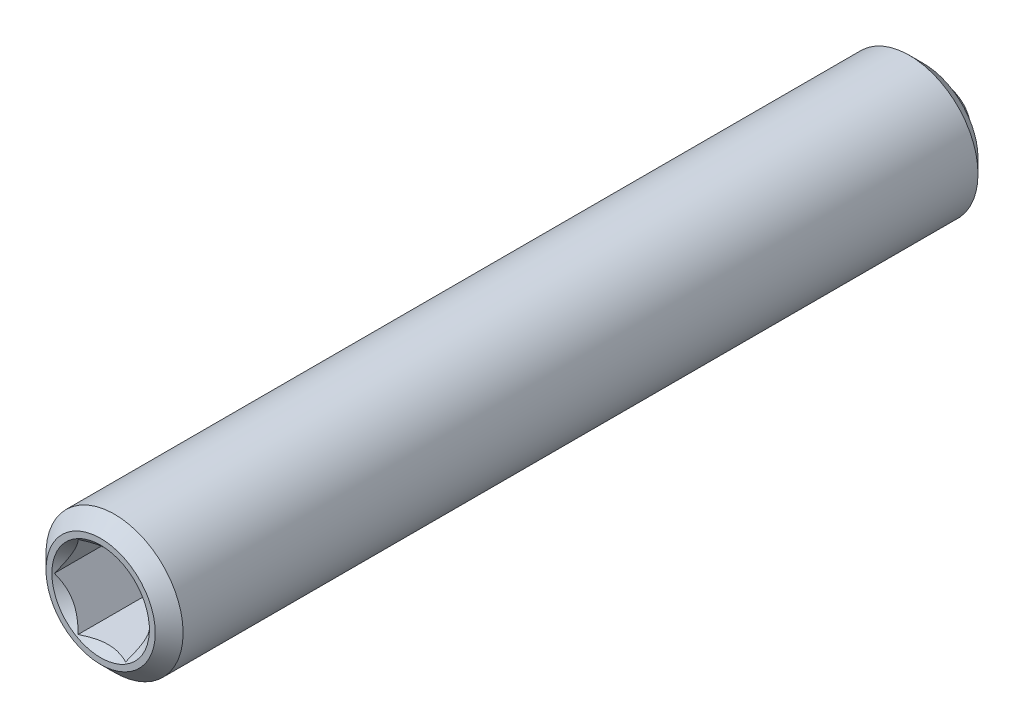
ISO-10303-21;
HEADER;
FILE_DESCRIPTION(('STEP AP214'),'2;1');
FILE_NAME('part.step','',(''),(''),'','','');
FILE_SCHEMA(('AUTOMOTIVE_DESIGN { 1 0 10303 214 1 1 1 1 }'));
ENDSEC;
DATA;
#1=APPLICATION_CONTEXT('core data for automotive mechanical design processes');
#2=APPLICATION_PROTOCOL_DEFINITION('international standard','automotive_design',2000,#1);
#3=PRODUCT_CONTEXT('',#1,'mechanical');
#4=PRODUCT('Part','Part','',(#3));
#5=PRODUCT_RELATED_PRODUCT_CATEGORY('part','',(#4));
#6=PRODUCT_DEFINITION_FORMATION('','',#4);
#7=PRODUCT_DEFINITION_CONTEXT('part definition',#1,'design');
#8=PRODUCT_DEFINITION('design','',#6,#7);
#9=PRODUCT_DEFINITION_SHAPE('','',#8);
#10=(LENGTH_UNIT() NAMED_UNIT(*) SI_UNIT(.MILLI.,.METRE.));
#11=(NAMED_UNIT(*) PLANE_ANGLE_UNIT() SI_UNIT($,.RADIAN.));
#12=(NAMED_UNIT(*) SI_UNIT($,.STERADIAN.) SOLID_ANGLE_UNIT());
#13=UNCERTAINTY_MEASURE_WITH_UNIT(LENGTH_MEASURE(1.E-05),#10,'distance_accuracy_value','');
#14=(GEOMETRIC_REPRESENTATION_CONTEXT(3) GLOBAL_UNCERTAINTY_ASSIGNED_CONTEXT((#13)) GLOBAL_UNIT_ASSIGNED_CONTEXT((#10,
#11,#12)) REPRESENTATION_CONTEXT('',''));
#15=CARTESIAN_POINT('',(0.,0.,0.));
#16=DIRECTION('',(0.,0.,1.));
#17=DIRECTION('',(1.,0.,0.));
#18=AXIS2_PLACEMENT_3D('',#15,#16,#17);
#19=CARTESIAN_POINT('',(-33.1630007981403,28.7089673374794,5.49521483447506));
#20=DIRECTION('',(0.,0.,-1.));
#21=DIRECTION('',(-1.,0.,0.));
#22=AXIS2_PLACEMENT_3D('',#19,#20,#21);
#23=PLANE('',#22);
#24=CARTESIAN_POINT('',(-33.1630007981403,28.7089673374794,5.49521483447506));
#25=DIRECTION('',(0.,0.,-1.));
#26=DIRECTION('',(0.,1.,0.));
#27=AXIS2_PLACEMENT_3D('',#24,#25,#26);
#28=CIRCLE('',#27,0.889);
#29=CARTESIAN_POINT('',(-33.1630007981403,29.5979673374794,5.49521483447506));
#30=VERTEX_POINT('',#29);
#31=EDGE_CURVE('P0_E164',#30,#30,#28,.T.);
#32=ORIENTED_EDGE('',*,*,#31,.T.);
#33=EDGE_LOOP('',(#32));
#34=FACE_BOUND('',#33,.T.);
#35=CARTESIAN_POINT('',(-33.1630007981403,28.7089673374794,5.49521483447506));
#36=DIRECTION('',(0.,0.,1.));
#37=DIRECTION('',(1.,0.,0.));
#38=AXIS2_PLACEMENT_3D('',#35,#36,#37);
#39=CIRCLE('',#38,0.996);
#40=CARTESIAN_POINT('',(-32.1670007981403,28.7089673374794,5.49521483447506));
#41=VERTEX_POINT('',#40);
#42=EDGE_CURVE('P0_E29',#41,#41,#39,.T.);
#43=ORIENTED_EDGE('',*,*,#42,.T.);
#44=EDGE_LOOP('',(#43));
#45=FACE_BOUND('',#44,.T.);
#46=ADVANCED_FACE('P0_F17',(#34,#45),#23,.F.);
#47=CARTESIAN_POINT('',(-33.1630007981403,28.7089673374794,5.24121483447506));
#48=DIRECTION('',(0.,0.,-1.));
#49=DIRECTION('',(-1.,0.,0.));
#50=AXIS2_PLACEMENT_3D('',#47,#48,#49);
#51=CONICAL_SURFACE('',#50,1.25,0.785398163397454);
#52=ORIENTED_EDGE('',*,*,#42,.F.);
#53=EDGE_LOOP('',(#52));
#54=FACE_BOUND('',#53,.T.);
#55=CARTESIAN_POINT('',(-33.1630007981403,28.7089673374794,5.24121483447506));
#56=DIRECTION('',(0.,0.,1.));
#57=DIRECTION('',(1.,0.,0.));
#58=AXIS2_PLACEMENT_3D('',#55,#56,#57);
#59=CIRCLE('',#58,1.25);
#60=CARTESIAN_POINT('',(-31.9130007981403,28.7089673374794,5.24121483447506));
#61=VERTEX_POINT('',#60);
#62=EDGE_CURVE('P0_E113',#61,#61,#59,.T.);
#63=ORIENTED_EDGE('',*,*,#62,.T.);
#64=EDGE_LOOP('',(#63));
#65=FACE_BOUND('',#64,.T.);
#66=ADVANCED_FACE('P0_F119',(#54,#65),#51,.T.);
#67=CARTESIAN_POINT('',(-33.1630007981403,28.7089673374794,57.6778825031788));
#68=DIRECTION('',(0.,0.,1.));
#69=DIRECTION('',(1.,0.,0.));
#70=AXIS2_PLACEMENT_3D('',#67,#68,#69);
#71=CYLINDRICAL_SURFACE('',#70,1.25);
#72=ORIENTED_EDGE('',*,*,#62,.F.);
#73=EDGE_LOOP('',(#72));
#74=FACE_BOUND('',#73,.T.);
#75=CARTESIAN_POINT('',(-33.1630007981403,28.7089673374794,-9.25078516552494));
#76=DIRECTION('',(0.,0.,1.));
#77=DIRECTION('',(1.,0.,0.));
#78=AXIS2_PLACEMENT_3D('',#75,#76,#77);
#79=CIRCLE('',#78,1.25);
#80=CARTESIAN_POINT('',(-31.9130007981403,28.7089673374794,-9.25078516552494));
#81=VERTEX_POINT('',#80);
#82=EDGE_CURVE('P0_E110',#81,#81,#79,.T.);
#83=ORIENTED_EDGE('',*,*,#82,.T.);
#84=EDGE_LOOP('',(#83));
#85=FACE_BOUND('',#84,.T.);
#86=ADVANCED_FACE('P0_F122',(#74,#85),#71,.T.);
#87=CARTESIAN_POINT('',(-33.1630007981403,28.7089673374794,-9.50478516552494));
#88=DIRECTION('',(0.,0.,1.));
#89=DIRECTION('',(1.,0.,0.));
#90=AXIS2_PLACEMENT_3D('',#87,#88,#89);
#91=CONICAL_SURFACE('',#90,0.996,0.78539816339744);
#92=ORIENTED_EDGE('',*,*,#82,.F.);
#93=EDGE_LOOP('',(#92));
#94=FACE_BOUND('',#93,.T.);
#95=CARTESIAN_POINT('',(-33.1630007981403,28.7089673374794,-9.50478516552494));
#96=DIRECTION('',(0.,0.,1.));
#97=DIRECTION('',(1.,0.,0.));
#98=AXIS2_PLACEMENT_3D('',#95,#96,#97);
#99=CIRCLE('',#98,0.996);
#100=CARTESIAN_POINT('',(-32.1670007981403,28.7089673374794,-9.50478516552494));
#101=VERTEX_POINT('',#100);
#102=EDGE_CURVE('P0_E107',#101,#101,#99,.T.);
#103=ORIENTED_EDGE('',*,*,#102,.T.);
#104=EDGE_LOOP('',(#103));
#105=FACE_BOUND('',#104,.T.);
#106=ADVANCED_FACE('P0_F127',(#94,#105),#91,.T.);
#107=CARTESIAN_POINT('',(-33.1630007981403,29.7049673374794,-9.50478516552494));
#108=DIRECTION('',(0.,0.,1.));
#109=DIRECTION('',(1.,0.,0.));
#110=AXIS2_PLACEMENT_3D('',#107,#108,#109);
#111=PLANE('',#110);
#112=ORIENTED_EDGE('',*,*,#102,.F.);
#113=EDGE_LOOP('',(#112));
#114=FACE_BOUND('',#113,.T.);
#115=CARTESIAN_POINT('',(-33.1630007981403,28.7089673374794,-9.50478516552494));
#116=DIRECTION('',(0.,0.,1.));
#117=DIRECTION('',(1.,0.,0.));
#118=AXIS2_PLACEMENT_3D('',#115,#116,#117);
#119=CIRCLE('',#118,0.75);
#120=CARTESIAN_POINT('',(-32.4130007981403,28.7089673374794,-9.50478516552494));
#121=VERTEX_POINT('',#120);
#122=EDGE_CURVE('P0_E104',#121,#121,#119,.T.);
#123=ORIENTED_EDGE('',*,*,#122,.T.);
#124=EDGE_LOOP('',(#123));
#125=FACE_BOUND('',#124,.T.);
#126=ADVANCED_FACE('P0_F133',(#114,#125),#111,.F.);
#127=CARTESIAN_POINT('',(-33.1630007981403,28.7089673374794,57.6778825031788));
#128=DIRECTION('',(0.,0.,1.));
#129=DIRECTION('',(1.,0.,0.));
#130=AXIS2_PLACEMENT_3D('',#127,#128,#129);
#131=CYLINDRICAL_SURFACE('',#130,0.75);
#132=ORIENTED_EDGE('',*,*,#122,.F.);
#133=EDGE_LOOP('',(#132));
#134=FACE_BOUND('',#133,.T.);
#135=CARTESIAN_POINT('',(-33.1630007981403,28.7089673374794,-9.00292499374513));
#136=DIRECTION('',(0.,0.,1.));
#137=DIRECTION('',(1.,0.,0.));
#138=AXIS2_PLACEMENT_3D('',#135,#136,#137);
#139=CIRCLE('',#138,0.75);
#140=CARTESIAN_POINT('',(-32.4130007981403,28.7089673374794,-9.00292499374513));
#141=VERTEX_POINT('',#140);
#142=EDGE_CURVE('P0_E101',#141,#141,#139,.T.);
#143=ORIENTED_EDGE('',*,*,#142,.T.);
#144=EDGE_LOOP('',(#143));
#145=FACE_BOUND('',#144,.T.);
#146=ADVANCED_FACE('P0_F139',(#134,#145),#131,.F.);
#147=CARTESIAN_POINT('',(-33.1630007981403,28.7089673374794,-8.25292499374511));
#148=DIRECTION('',(0.,0.,-1.));
#149=DIRECTION('',(-1.,0.,0.));
#150=AXIS2_PLACEMENT_3D('',#147,#148,#149);
#151=CONICAL_SURFACE('',#150,0.,0.785398163397436);
#152=ORIENTED_EDGE('',*,*,#142,.F.);
#153=EDGE_LOOP('',(#152));
#154=FACE_BOUND('',#153,.T.);
#155=CARTESIAN_POINT('',(-33.1630007981403,28.7089673374794,-8.25292499374511));
#156=VERTEX_POINT('',#155);
#157=VERTEX_LOOP('',#156);
#158=FACE_BOUND('',#157,.T.);
#159=ADVANCED_FACE('P0_F145',(#154,#158),#151,.F.);
#160=CARTESIAN_POINT('',(-33.1630007981403,28.7089673374794,4.60621483447507));
#161=DIRECTION('',(0.,0.,1.));
#162=DIRECTION('',(0.,-1.,0.));
#163=AXIS2_PLACEMENT_3D('',#160,#161,#162);
#164=CONICAL_SURFACE('',#163,0.,0.785398163397454);
#165=ORIENTED_EDGE('',*,*,#31,.F.);
#166=EDGE_LOOP('',(#165));
#167=FACE_BOUND('',#166,.T.);
#168=CARTESIAN_POINT('',(-34.0425134321986,27.9589673374794,5.76208786966026));
#169=CARTESIAN_POINT('',(-34.0211681100344,27.9589673374794,5.74584847947383));
#170=CARTESIAN_POINT('',(-33.9997055705422,27.9589673374794,5.72976358783385));
#171=CARTESIAN_POINT('',(-33.9564979950275,27.9589673374794,5.69796706739638));
#172=CARTESIAN_POINT('',(-33.9347528915436,27.9589673374794,5.68225553036631));
#173=CARTESIAN_POINT('',(-33.8687032144859,27.9589673374794,5.63555296646633));
#174=CARTESIAN_POINT('',(-33.8239085172943,27.9589673374794,5.60524382432147));
#175=CARTESIAN_POINT('',(-33.7298709247186,27.9589673374794,5.54559584174304));
#176=CARTESIAN_POINT('',(-33.6805219918868,27.9589673374794,5.51642227384625));
#177=CARTESIAN_POINT('',(-33.579342395383,27.9589673374794,5.46295382695284));
#178=CARTESIAN_POINT('',(-33.5275208693121,27.9589673374794,5.43864248318659));
#179=CARTESIAN_POINT('',(-33.4498788861714,27.9589673374794,5.40889806815176));
#180=CARTESIAN_POINT('',(-33.4252462031009,27.9589673374794,5.40038894634061));
#181=CARTESIAN_POINT('',(-33.3753858857222,27.9589673374794,5.38534110821305));
#182=CARTESIAN_POINT('',(-33.3501582118539,27.9589673374794,5.37880252331568));
#183=CARTESIAN_POINT('',(-33.2746553170791,27.9589673374794,5.36292205991524));
#184=CARTESIAN_POINT('',(-33.2235971883066,27.9589673374794,5.35692036145107));
#185=CARTESIAN_POINT('',(-33.1233397305914,27.9589673374794,5.35565407881637));
#186=CARTESIAN_POINT('',(-33.0741456969587,27.9589673374794,5.35997925251151));
#187=CARTESIAN_POINT('',(-33.0012050800911,27.9589673374794,5.37307755969887));
#188=CARTESIAN_POINT('',(-32.9768127738478,27.9589673374794,5.37862812797235));
#189=CARTESIAN_POINT('',(-32.9285520824627,27.9589673374794,5.39166394378376));
#190=CARTESIAN_POINT('',(-32.9046836591211,27.9589673374794,5.39914904975033));
#191=CARTESIAN_POINT('',(-32.8302496642989,27.9589673374794,5.42532907949656));
#192=CARTESIAN_POINT('',(-32.7807289039953,27.9589673374794,5.44697769298002));
#193=CARTESIAN_POINT('',(-32.6840052994642,27.9589673374794,5.4951286727266));
#194=CARTESIAN_POINT('',(-32.6368115002835,27.9589673374794,5.52164833509715));
#195=CARTESIAN_POINT('',(-32.546608344391,27.9589673374794,5.57638182509845));
#196=CARTESIAN_POINT('',(-32.5035074965681,27.9589673374794,5.60444679240507));
#197=CARTESIAN_POINT('',(-32.4400071849266,27.9589673374794,5.64784121680964));
#198=CARTESIAN_POINT('',(-32.4191140713775,27.9589673374794,5.66246076309093));
#199=CARTESIAN_POINT('',(-32.3776138434408,27.9589673374794,5.69208888193887));
#200=CARTESIAN_POINT('',(-32.3570066523079,27.9589673374794,5.70709734688724));
#201=CARTESIAN_POINT('',(-32.3365186272487,27.9589673374794,5.72226715350033));
#202=B_SPLINE_CURVE_WITH_KNOTS('',3,(#168,#169,#170,#171,#172,#173,#174,#175,#176,#177,#178,
#179,#180,#181,#182,#183,#184,#185,#186,#187,#188,#189,#190,#191,#192,#193,#194,#195,#196,#197,
#198,#199,#200,#201),.UNSPECIFIED.,.F.,.F.,(4,2,2,2,2,2,2,2,2,2,2,2,2,2,2,2,4),(0.,
0.0804596117681708,0.16093879945203,0.32312445319498,0.494968571191812,0.666220542229091,
0.744331171665941,0.822447009304217,0.975597152051806,1.1227651436875,1.19774306447282,
1.2727154998528,1.43438364653412,1.59663734906445,1.75085876684993,1.82735598888857,
1.90383226465776),.UNSPECIFIED.);
#203=CARTESIAN_POINT('',(-33.5960135000325,27.9589673374794,5.4722402382595));
#204=VERTEX_POINT('',#203);
#205=CARTESIAN_POINT('',(-32.7299880962481,27.9589673374794,5.4722402382595));
#206=VERTEX_POINT('',#205);
#207=EDGE_CURVE('P0_E85',#204,#206,#202,.T.);
#208=ORIENTED_EDGE('',*,*,#207,.F.);
#209=CARTESIAN_POINT('',(-34.0291416719786,28.7091673374794,5.47235573140427));
#210=CARTESIAN_POINT('',(-34.0142518301535,28.6833773749217,5.45747434872342));
#211=CARTESIAN_POINT('',(-33.9991129904287,28.6571561353507,5.44346650386646));
#212=CARTESIAN_POINT('',(-33.9682429340346,28.6036876292437,5.41781776294176));
#213=CARTESIAN_POINT('',(-33.9525087771001,28.5764352700188,5.40619114996516));
#214=CARTESIAN_POINT('',(-33.9207814844129,28.5214819870981,5.38627428403174));
#215=CARTESIAN_POINT('',(-33.9047964415994,28.4937950807839,5.37793393234087));
#216=CARTESIAN_POINT('',(-33.8724744460836,28.4378117423485,5.36508298022093));
#217=CARTESIAN_POINT('',(-33.8561384820408,28.4095170226358,5.36056277884834));
#218=CARTESIAN_POINT('',(-33.8279868976807,28.3607570482106,5.35648607135694));
#219=CARTESIAN_POINT('',(-33.8162079265919,28.3403552718238,5.35588303487358));
#220=CARTESIAN_POINT('',(-33.792672780358,28.299591202783,5.35689474427503));
#221=CARTESIAN_POINT('',(-33.7809166108125,28.279228919828,5.35850997924953));
#222=CARTESIAN_POINT('',(-33.7458159514267,28.2184327943926,5.36657638523254));
#223=CARTESIAN_POINT('',(-33.722646127693,28.1783014824833,5.37624917408722));
#224=CARTESIAN_POINT('',(-33.6819749504676,28.1078569371254,5.39959655623182));
#225=CARTESIAN_POINT('',(-33.6642831070638,28.0772137654703,5.41204879633175));
#226=CARTESIAN_POINT('',(-33.6295925693883,28.0171279916746,5.44009984849036));
#227=CARTESIAN_POINT('',(-33.612591831045,27.9876818490978,5.45568842416325));
#228=CARTESIAN_POINT('',(-33.5958980299787,27.9587673374794,5.47235573140427));
#229=B_SPLINE_CURVE_WITH_KNOTS('',3,(#209,#210,#211,#212,#213,#214,#215,#216,#217,#218,#219,
#220,#221,#222,#223,#224,#225,#226,#227,#228),.UNSPECIFIED.,.F.,.F.,(4,2,2,2,2,2,2,2,2,4),(0.,
0.0999419466095622,0.200466857654447,0.299393763705727,0.39807129730023,0.468665775681748,
0.539275821398842,0.68053625724457,0.792918418368075,0.904939568716029),.UNSPECIFIED.);
#230=CARTESIAN_POINT('',(-34.0290262019247,28.7089673374794,5.4722402382595));
#231=VERTEX_POINT('',#230);
#232=EDGE_CURVE('P0_E227',#231,#204,#229,.T.);
#233=ORIENTED_EDGE('',*,*,#232,.F.);
#234=CARTESIAN_POINT('',(-33.5958980299787,29.4591673374794,5.47235573140427));
#235=CARTESIAN_POINT('',(-33.6107878718037,29.4333773749217,5.45747434872343));
#236=CARTESIAN_POINT('',(-33.6259267115285,29.4071561353507,5.44346650386646));
#237=CARTESIAN_POINT('',(-33.6567967679226,29.3536876292437,5.41781776294176));
#238=CARTESIAN_POINT('',(-33.6725309248571,29.3264352700188,5.40619114996517));
#239=CARTESIAN_POINT('',(-33.7042582175443,29.2714819870981,5.38627428403175));
#240=CARTESIAN_POINT('',(-33.7202432603578,29.2437950807839,5.37793393234088));
#241=CARTESIAN_POINT('',(-33.7525652558736,29.1878117423486,5.36508298022093));
#242=CARTESIAN_POINT('',(-33.7689012199164,29.1595170226358,5.36056277884834));
#243=CARTESIAN_POINT('',(-33.7970528042765,29.1107570482106,5.35648607135694));
#244=CARTESIAN_POINT('',(-33.8088317753653,29.0903552718238,5.35588303487358));
#245=CARTESIAN_POINT('',(-33.8323669215993,29.049591202783,5.35689474427503));
#246=CARTESIAN_POINT('',(-33.8441230911447,29.029228919828,5.35850997924954));
#247=CARTESIAN_POINT('',(-33.8792237505305,28.9684327943926,5.36657638523254));
#248=CARTESIAN_POINT('',(-33.9023935742642,28.9283014824833,5.37624917408722));
#249=CARTESIAN_POINT('',(-33.9430647514896,28.8578569371254,5.39959655623182));
#250=CARTESIAN_POINT('',(-33.9607565948934,28.8272137654703,5.41204879633176));
#251=CARTESIAN_POINT('',(-33.9954471325689,28.7671279916746,5.44009984849036));
#252=CARTESIAN_POINT('',(-34.0124478709122,28.7376818490978,5.45568842416325));
#253=CARTESIAN_POINT('',(-34.0291416719786,28.7087673374794,5.47235573140427));
#254=B_SPLINE_CURVE_WITH_KNOTS('',3,(#234,#235,#236,#237,#238,#239,#240,#241,#242,#243,#244,
#245,#246,#247,#248,#249,#250,#251,#252,#253),.UNSPECIFIED.,.F.,.F.,(4,2,2,2,2,2,2,2,2,4),(0.,
0.0999419466095611,0.200466857654446,0.299393763705716,0.398071297300229,0.468665775681751,
0.539275821398841,0.680536257244569,0.792918418368074,0.904939568716027),.UNSPECIFIED.);
#255=CARTESIAN_POINT('',(-33.5960135000325,29.4589673374794,5.4722402382595));
#256=VERTEX_POINT('',#255);
#257=EDGE_CURVE('P0_E166',#256,#231,#254,.T.);
#258=ORIENTED_EDGE('',*,*,#257,.F.);
#259=CARTESIAN_POINT('',(-34.0425134322245,29.4589673374794,5.76208786967997));
#260=CARTESIAN_POINT('',(-34.0211681100595,29.4589673374794,5.74584847949278));
#261=CARTESIAN_POINT('',(-33.9997055705666,29.4589673374794,5.72976358785203));
#262=CARTESIAN_POINT('',(-33.9564979950504,29.4589673374794,5.69796706741305));
#263=CARTESIAN_POINT('',(-33.9347528915658,29.4589673374794,5.68225553038223));
#264=CARTESIAN_POINT('',(-33.8687032145059,29.4589673374794,5.63555296647996));
#265=CARTESIAN_POINT('',(-33.8239085173127,29.4589673374794,5.60524382433359));
#266=CARTESIAN_POINT('',(-33.7298709247336,29.4589673374794,5.54559584175205));
#267=CARTESIAN_POINT('',(-33.6805219919,29.4589673374794,5.51642227385366));
#268=CARTESIAN_POINT('',(-33.5793423953923,29.4589673374794,5.46295382695729));
#269=CARTESIAN_POINT('',(-33.5275208693195,29.4589673374794,5.43864248318969));
#270=CARTESIAN_POINT('',(-33.4498788861772,29.4589673374794,5.40889806815386));
#271=CARTESIAN_POINT('',(-33.4252462031073,29.4589673374794,5.40038894634276));
#272=CARTESIAN_POINT('',(-33.3753858857299,29.4589673374794,5.38534110821518));
#273=CARTESIAN_POINT('',(-33.3501582118623,29.4589673374794,5.37880252331774));
#274=CARTESIAN_POINT('',(-33.2746553170894,29.4589673374794,5.36292205991685));
#275=CARTESIAN_POINT('',(-33.2235971883182,29.4589673374794,5.35692036145209));
#276=CARTESIAN_POINT('',(-33.1233397306052,29.4589673374794,5.35565407881571));
#277=CARTESIAN_POINT('',(-33.0741456969734,29.4589673374794,5.35997925250981));
#278=CARTESIAN_POINT('',(-33.0012050801071,29.4589673374794,5.3730775596955));
#279=CARTESIAN_POINT('',(-32.9768127738643,29.4589673374794,5.37862812796839));
#280=CARTESIAN_POINT('',(-32.9285520824799,29.4589673374794,5.39166394377863));
#281=CARTESIAN_POINT('',(-32.9046836591387,29.4589673374794,5.3991490497446));
#282=CARTESIAN_POINT('',(-32.8302496643203,29.4589673374794,5.42532907948803));
#283=CARTESIAN_POINT('',(-32.78072890402,29.4589673374794,5.44697769296891));
#284=CARTESIAN_POINT('',(-32.684005299495,29.4589673374794,5.49512867271008));
#285=CARTESIAN_POINT('',(-32.6368115003173,29.4589673374794,5.52164833507777));
#286=CARTESIAN_POINT('',(-32.5466083444301,29.4589673374794,5.5763818250736));
#287=CARTESIAN_POINT('',(-32.5035074966097,29.4589673374794,5.60444679237763));
#288=CARTESIAN_POINT('',(-32.4400071849717,29.4589673374794,5.64784121677833));
#289=CARTESIAN_POINT('',(-32.4191140714238,29.4589673374794,5.66246076305834));
#290=CARTESIAN_POINT('',(-32.3776138434894,29.4589673374794,5.69208888190373));
#291=CARTESIAN_POINT('',(-32.3570066523577,29.4589673374794,5.70709734685082));
#292=CARTESIAN_POINT('',(-32.3365186272996,29.4589673374794,5.72226715346264));
#293=B_SPLINE_CURVE_WITH_KNOTS('',3,(#259,#260,#261,#262,#263,#264,#265,#266,#267,#268,#269,
#270,#271,#272,#273,#274,#275,#276,#277,#278,#279,#280,#281,#282,#283,#284,#285,#286,#287,#288,
#289,#290,#291,#292),.UNSPECIFIED.,.F.,.F.,(4,2,2,2,2,2,2,2,2,2,2,2,2,2,2,2,4),(0.,
0.0804596117713154,0.160938799458303,0.323124453207644,0.494968571211668,0.666220542256048,
0.744331171691058,0.82244700932749,0.975597152071559,1.12276514370424,1.19774306448794,
1.2727154998663,1.43438364653571,1.59663734905406,1.75085876682929,1.82735598886286,
1.90383226462701),.UNSPECIFIED.);
#294=CARTESIAN_POINT('',(-32.7299880962481,29.4589673374794,5.4722402382595));
#295=VERTEX_POINT('',#294);
#296=EDGE_CURVE('P0_E36',#295,#256,#293,.F.);
#297=ORIENTED_EDGE('',*,*,#296,.F.);
#298=CARTESIAN_POINT('',(-32.296859924302,28.7087673374794,5.47235573140427));
#299=CARTESIAN_POINT('',(-32.3117497661271,28.7345573000371,5.45747434872342));
#300=CARTESIAN_POINT('',(-32.3268886058519,28.7607785396081,5.44346650386646));
#301=CARTESIAN_POINT('',(-32.3577586622459,28.8142470457151,5.41781776294176));
#302=CARTESIAN_POINT('',(-32.3734928191805,28.84149940494,5.40619114996516));
#303=CARTESIAN_POINT('',(-32.4052201118676,28.8964526878608,5.38627428403174));
#304=CARTESIAN_POINT('',(-32.4212051546811,28.9241395941749,5.37793393234087));
#305=CARTESIAN_POINT('',(-32.4535271501969,28.9801229326103,5.36508298022093));
#306=CARTESIAN_POINT('',(-32.4698631142397,29.0084176523231,5.36056277884834));
#307=CARTESIAN_POINT('',(-32.4980146985998,29.0571776267483,5.35648607135694));
#308=CARTESIAN_POINT('',(-32.5097936696886,29.077579403135,5.35588303487358));
#309=CARTESIAN_POINT('',(-32.5333288159226,29.1183434721758,5.35689474427503));
#310=CARTESIAN_POINT('',(-32.545084985468,29.1387057551309,5.35850997924953));
#311=CARTESIAN_POINT('',(-32.5801856448538,29.1995018805662,5.36657638523254));
#312=CARTESIAN_POINT('',(-32.6033554685876,29.2396331924755,5.37624917408722));
#313=CARTESIAN_POINT('',(-32.6440266458129,29.3100777378334,5.39959655623182));
#314=CARTESIAN_POINT('',(-32.6617184892168,29.3407209094885,5.41204879633175));
#315=CARTESIAN_POINT('',(-32.6964090268922,29.4008066832842,5.44009984849036));
#316=CARTESIAN_POINT('',(-32.7134097652355,29.430252825861,5.45568842416325));
#317=CARTESIAN_POINT('',(-32.7301035663019,29.4591673374794,5.47235573140427));
#318=B_SPLINE_CURVE_WITH_KNOTS('',3,(#298,#299,#300,#301,#302,#303,#304,#305,#306,#307,#308,
#309,#310,#311,#312,#313,#314,#315,#316,#317),.UNSPECIFIED.,.F.,.F.,(4,2,2,2,2,2,2,2,2,4),(0.,
0.0999419466095622,0.200466857654447,0.299393763705714,0.39807129730023,0.468665775681749,
0.539275821398842,0.68053625724457,0.792918418368071,0.904939568716029),.UNSPECIFIED.);
#319=CARTESIAN_POINT('',(-32.2969753943558,28.7089673374794,5.4722402382595));
#320=VERTEX_POINT('',#319);
#321=EDGE_CURVE('P0_E11',#320,#295,#318,.T.);
#322=ORIENTED_EDGE('',*,*,#321,.F.);
#323=CARTESIAN_POINT('',(-32.7301035663019,27.9587673374794,5.47235573140427));
#324=CARTESIAN_POINT('',(-32.7152137244768,27.9845573000371,5.45747434872343));
#325=CARTESIAN_POINT('',(-32.700074884752,28.0107785396081,5.44346650386646));
#326=CARTESIAN_POINT('',(-32.669204828358,28.0642470457151,5.41781776294176));
#327=CARTESIAN_POINT('',(-32.6534706714234,28.09149940494,5.40619114996517));
#328=CARTESIAN_POINT('',(-32.6217433787363,28.1464526878608,5.38627428403175));
#329=CARTESIAN_POINT('',(-32.6057583359228,28.1741395941749,5.37793393234087));
#330=CARTESIAN_POINT('',(-32.573436340407,28.2301229326103,5.36508298022093));
#331=CARTESIAN_POINT('',(-32.5571003763642,28.2584176523231,5.36056277884834));
#332=CARTESIAN_POINT('',(-32.5289487920041,28.3071776267483,5.35648607135694));
#333=CARTESIAN_POINT('',(-32.5171698209153,28.327579403135,5.35588303487358));
#334=CARTESIAN_POINT('',(-32.4936346746813,28.3683434721758,5.35689474427503));
#335=CARTESIAN_POINT('',(-32.4818785051359,28.3887057551309,5.35850997924954));
#336=CARTESIAN_POINT('',(-32.4467778457501,28.4495018805662,5.36657638523254));
#337=CARTESIAN_POINT('',(-32.4236080220163,28.4896331924755,5.37624917408722));
#338=CARTESIAN_POINT('',(-32.382936844791,28.5600777378334,5.39959655623182));
#339=CARTESIAN_POINT('',(-32.3652450013871,28.5907209094885,5.41204879633176));
#340=CARTESIAN_POINT('',(-32.3305544637117,28.6508066832842,5.44009984849036));
#341=CARTESIAN_POINT('',(-32.3135537253684,28.680252825861,5.45568842416325));
#342=CARTESIAN_POINT('',(-32.296859924302,28.7091673374794,5.47235573140427));
#343=B_SPLINE_CURVE_WITH_KNOTS('',3,(#323,#324,#325,#326,#327,#328,#329,#330,#331,#332,#333,
#334,#335,#336,#337,#338,#339,#340,#341,#342),.UNSPECIFIED.,.F.,.F.,(4,2,2,2,2,2,2,2,2,4),(0.,
0.0999419466095604,0.200466857654448,0.299393763705719,0.398071297300229,0.46866577568175,
0.539275821398841,0.680536257244568,0.79291841836807,0.904939568716026),.UNSPECIFIED.);
#344=EDGE_CURVE('P0_E72',#206,#320,#343,.T.);
#345=ORIENTED_EDGE('',*,*,#344,.F.);
#346=EDGE_LOOP('',(#208,#233,#258,#297,#322,#345));
#347=FACE_BOUND('',#346,.T.);
#348=ADVANCED_FACE('P0_F71',(#167,#347),#164,.F.);
#349=CARTESIAN_POINT('',(-32.2969753943558,28.7089673374794,2.44721483447506));
#350=DIRECTION('',(0.,0.,1.));
#351=DIRECTION('',(1.,0.,0.));
#352=AXIS2_PLACEMENT_3D('',#349,#350,#351);
#353=PLANE('',#352);
#354=DIRECTION('',(0.5,0.866025403784439,0.));
#355=VECTOR('',#354,1.);
#356=CARTESIAN_POINT('',(-32.7299880962481,27.9589673374794,2.44721483447506));
#357=LINE('',#356,#355);
#358=CARTESIAN_POINT('',(-32.7299880962481,27.9589673374794,2.44721483447506));
#359=VERTEX_POINT('',#358);
#360=CARTESIAN_POINT('',(-32.2969753943558,28.7089673374794,2.44721483447506));
#361=VERTEX_POINT('',#360);
#362=EDGE_CURVE('P0_E84',#359,#361,#357,.T.);
#363=ORIENTED_EDGE('',*,*,#362,.T.);
#364=DIRECTION('',(-0.500000000000001,0.866025403784438,0.));
#365=VECTOR('',#364,1.);
#366=CARTESIAN_POINT('',(-32.2969753943558,28.7089673374794,2.44721483447506));
#367=LINE('',#366,#365);
#368=CARTESIAN_POINT('',(-32.7299880962481,29.4589673374794,2.44721483447506));
#369=VERTEX_POINT('',#368);
#370=EDGE_CURVE('P0_E89',#361,#369,#367,.T.);
#371=ORIENTED_EDGE('',*,*,#370,.T.);
#372=DIRECTION('',(-1.,0.,0.));
#373=VECTOR('',#372,1.);
#374=CARTESIAN_POINT('',(-32.7299880962481,29.4589673374794,2.44721483447506));
#375=LINE('',#374,#373);
#376=CARTESIAN_POINT('',(-33.5960135000325,29.4589673374794,2.44721483447506));
#377=VERTEX_POINT('',#376);
#378=EDGE_CURVE('P0_E203',#369,#377,#375,.T.);
#379=ORIENTED_EDGE('',*,*,#378,.T.);
#380=DIRECTION('',(-0.5,-0.866025403784439,0.));
#381=VECTOR('',#380,1.);
#382=CARTESIAN_POINT('',(-33.5960135000325,29.4589673374794,2.44721483447506));
#383=LINE('',#382,#381);
#384=CARTESIAN_POINT('',(-34.0290262019247,28.7089673374794,2.44721483447506));
#385=VERTEX_POINT('',#384);
#386=EDGE_CURVE('P0_E206',#377,#385,#383,.T.);
#387=ORIENTED_EDGE('',*,*,#386,.T.);
#388=DIRECTION('',(0.5,-0.866025403784438,0.));
#389=VECTOR('',#388,1.);
#390=CARTESIAN_POINT('',(-34.0290262019247,28.7089673374794,2.44721483447506));
#391=LINE('',#390,#389);
#392=CARTESIAN_POINT('',(-33.5960135000325,27.9589673374794,2.44721483447506));
#393=VERTEX_POINT('',#392);
#394=EDGE_CURVE('P0_E97',#385,#393,#391,.T.);
#395=ORIENTED_EDGE('',*,*,#394,.T.);
#396=DIRECTION('',(1.,0.,0.));
#397=VECTOR('',#396,1.);
#398=CARTESIAN_POINT('',(-33.5960135000325,27.9589673374794,2.44721483447506));
#399=LINE('',#398,#397);
#400=EDGE_CURVE('P0_E92',#393,#359,#399,.T.);
#401=ORIENTED_EDGE('',*,*,#400,.T.);
#402=EDGE_LOOP('',(#363,#371,#379,#387,#395,#401));
#403=FACE_BOUND('',#402,.T.);
#404=ADVANCED_FACE('P0_F155',(#403),#353,.T.);
#405=CARTESIAN_POINT('',(-32.2969753943558,28.7089673374794,2.44721483447506));
#406=DIRECTION('',(0.866025403784438,0.500000000000001,0.));
#407=DIRECTION('',(-0.500000000000001,0.866025403784438,0.));
#408=AXIS2_PLACEMENT_3D('',#405,#406,#407);
#409=PLANE('',#408);
#410=DIRECTION('',(0.,0.,1.));
#411=VECTOR('',#410,1.);
#412=CARTESIAN_POINT('',(-32.2969753943558,28.7089673374794,2.44721483447506));
#413=LINE('',#412,#411);
#414=EDGE_CURVE('P0_E81',#361,#320,#413,.T.);
#415=ORIENTED_EDGE('',*,*,#414,.T.);
#416=ORIENTED_EDGE('',*,*,#321,.T.);
#417=DIRECTION('',(0.,0.,1.));
#418=VECTOR('',#417,1.);
#419=CARTESIAN_POINT('',(-32.7299880962481,29.4589673374794,2.44721483447506));
#420=LINE('',#419,#418);
#421=EDGE_CURVE('P0_E91',#369,#295,#420,.T.);
#422=ORIENTED_EDGE('',*,*,#421,.F.);
#423=ORIENTED_EDGE('',*,*,#370,.F.);
#424=EDGE_LOOP('',(#415,#416,#422,#423));
#425=FACE_BOUND('',#424,.T.);
#426=ADVANCED_FACE('P0_F87',(#425),#409,.F.);
#427=CARTESIAN_POINT('',(-32.7299880962481,29.4589673374794,2.44721483447506));
#428=DIRECTION('',(0.,1.,0.));
#429=DIRECTION('',(-1.,0.,0.));
#430=AXIS2_PLACEMENT_3D('',#427,#428,#429);
#431=PLANE('',#430);
#432=ORIENTED_EDGE('',*,*,#421,.T.);
#433=ORIENTED_EDGE('',*,*,#296,.T.);
#434=DIRECTION('',(0.,0.,1.));
#435=VECTOR('',#434,1.);
#436=CARTESIAN_POINT('',(-33.5960135000325,29.4589673374794,2.44721483447506));
#437=LINE('',#436,#435);
#438=EDGE_CURVE('P0_E94',#377,#256,#437,.T.);
#439=ORIENTED_EDGE('',*,*,#438,.F.);
#440=ORIENTED_EDGE('',*,*,#378,.F.);
#441=EDGE_LOOP('',(#432,#433,#439,#440));
#442=FACE_BOUND('',#441,.T.);
#443=ADVANCED_FACE('P0_F180',(#442),#431,.F.);
#444=CARTESIAN_POINT('',(-33.5960135000325,29.4589673374794,2.44721483447506));
#445=DIRECTION('',(-0.866025403784439,0.5,0.));
#446=DIRECTION('',(-0.5,-0.866025403784439,0.));
#447=AXIS2_PLACEMENT_3D('',#444,#445,#446);
#448=PLANE('',#447);
#449=ORIENTED_EDGE('',*,*,#438,.T.);
#450=ORIENTED_EDGE('',*,*,#257,.T.);
#451=DIRECTION('',(0.,0.,1.));
#452=VECTOR('',#451,1.);
#453=CARTESIAN_POINT('',(-34.0290262019247,28.7089673374794,2.44721483447506));
#454=LINE('',#453,#452);
#455=EDGE_CURVE('P0_E215',#385,#231,#454,.T.);
#456=ORIENTED_EDGE('',*,*,#455,.F.);
#457=ORIENTED_EDGE('',*,*,#386,.F.);
#458=EDGE_LOOP('',(#449,#450,#456,#457));
#459=FACE_BOUND('',#458,.T.);
#460=ADVANCED_FACE('P0_F183',(#459),#448,.F.);
#461=CARTESIAN_POINT('',(-34.0290262019247,28.7089673374794,2.44721483447506));
#462=DIRECTION('',(-0.866025403784438,-0.5,0.));
#463=DIRECTION('',(0.5,-0.866025403784438,0.));
#464=AXIS2_PLACEMENT_3D('',#461,#462,#463);
#465=PLANE('',#464);
#466=ORIENTED_EDGE('',*,*,#455,.T.);
#467=ORIENTED_EDGE('',*,*,#232,.T.);
#468=DIRECTION('',(0.,0.,1.));
#469=VECTOR('',#468,1.);
#470=CARTESIAN_POINT('',(-33.5960135000325,27.9589673374794,2.44721483447506));
#471=LINE('',#470,#469);
#472=EDGE_CURVE('P0_E212',#393,#204,#471,.T.);
#473=ORIENTED_EDGE('',*,*,#472,.F.);
#474=ORIENTED_EDGE('',*,*,#394,.F.);
#475=EDGE_LOOP('',(#466,#467,#473,#474));
#476=FACE_BOUND('',#475,.T.);
#477=ADVANCED_FACE('P0_F232',(#476),#465,.F.);
#478=CARTESIAN_POINT('',(-33.5960135000325,27.9589673374794,2.44721483447506));
#479=DIRECTION('',(0.,-1.,0.));
#480=DIRECTION('',(0.,0.,-1.));
#481=AXIS2_PLACEMENT_3D('',#478,#479,#480);
#482=PLANE('',#481);
#483=ORIENTED_EDGE('',*,*,#472,.T.);
#484=ORIENTED_EDGE('',*,*,#207,.T.);
#485=DIRECTION('',(0.,0.,1.));
#486=VECTOR('',#485,1.);
#487=CARTESIAN_POINT('',(-32.7299880962481,27.9589673374794,2.44721483447506));
#488=LINE('',#487,#486);
#489=EDGE_CURVE('P0_E83',#359,#206,#488,.T.);
#490=ORIENTED_EDGE('',*,*,#489,.F.);
#491=ORIENTED_EDGE('',*,*,#400,.F.);
#492=EDGE_LOOP('',(#483,#484,#490,#491));
#493=FACE_BOUND('',#492,.T.);
#494=ADVANCED_FACE('P0_F191',(#493),#482,.F.);
#495=CARTESIAN_POINT('',(-32.7299880962481,27.9589673374794,2.44721483447506));
#496=DIRECTION('',(0.866025403784439,-0.5,0.));
#497=DIRECTION('',(0.5,0.866025403784439,0.));
#498=AXIS2_PLACEMENT_3D('',#495,#496,#497);
#499=PLANE('',#498);
#500=ORIENTED_EDGE('',*,*,#489,.T.);
#501=ORIENTED_EDGE('',*,*,#344,.T.);
#502=ORIENTED_EDGE('',*,*,#414,.F.);
#503=ORIENTED_EDGE('',*,*,#362,.F.);
#504=EDGE_LOOP('',(#500,#501,#502,#503));
#505=FACE_BOUND('',#504,.T.);
#506=ADVANCED_FACE('P0_F79',(#505),#499,.F.);
#507=CLOSED_SHELL('',(#46,#66,#86,#106,#126,#146,#159,#348,#404,#426,#443,#460,#477,#494,#506));
#508=MANIFOLD_SOLID_BREP('P0_B1',#507);
#509=CARTESIAN_POINT('',(-33.1630007981403,28.7089673374794,-9.31358516552495));
#510=DIRECTION('',(0.,0.,-1.));
#511=DIRECTION('',(1.,0.,0.));
#512=AXIS2_PLACEMENT_3D('',#509,#510,#511);
#513=SPHERICAL_SURFACE('',#512,0.75);
#514=CARTESIAN_POINT('',(-33.1630007981403,28.7089673374794,-9.31358516552495));
#515=DIRECTION('',(0.,0.999999999999956,0.));
#516=DIRECTION('',(1.,0.,0.));
#517=AXIS2_PLACEMENT_3D('',#514,#515,#516);
#518=CIRCLE('',#517,0.75);
#519=CARTESIAN_POINT('',(-32.4130007981403,28.7089673374794,-9.31358516552495));
#520=VERTEX_POINT('',#519);
#521=CARTESIAN_POINT('',(-33.9130007981403,28.7089673374794,-9.31358516552495));
#522=VERTEX_POINT('',#521);
#523=EDGE_CURVE('P1_E33',#520,#522,#518,.T.);
#524=ORIENTED_EDGE('',*,*,#523,.T.);
#525=CARTESIAN_POINT('',(-33.1630007981403,28.7089673374794,-9.31358516552495));
#526=DIRECTION('',(0.,0.,-1.));
#527=DIRECTION('',(0.,0.999999999999956,0.));
#528=AXIS2_PLACEMENT_3D('',#525,#526,#527);
#529=CIRCLE('',#528,0.75);
#530=EDGE_CURVE('P1_E10',#522,#520,#529,.T.);
#531=ORIENTED_EDGE('',*,*,#530,.T.);
#532=EDGE_LOOP('',(#524,#531));
#533=FACE_BOUND('',#532,.T.);
#534=ADVANCED_FACE('P1_F16',(#533),#513,.T.);
#535=ORIENTED_EDGE('',*,*,#523,.F.);
#536=CARTESIAN_POINT('',(-33.1630007981403,28.7089673374794,-9.31358516552495));
#537=DIRECTION('',(0.,0.,-1.));
#538=DIRECTION('',(0.,0.999999999999956,0.));
#539=AXIS2_PLACEMENT_3D('',#536,#537,#538);
#540=CIRCLE('',#539,0.75);
#541=EDGE_CURVE('P1_E23',#520,#522,#540,.T.);
#542=ORIENTED_EDGE('',*,*,#541,.T.);
#543=EDGE_LOOP('',(#535,#542));
#544=FACE_BOUND('',#543,.T.);
#545=ADVANCED_FACE('P1_F40',(#544),#513,.T.);
#546=ORIENTED_EDGE('',*,*,#530,.F.);
#547=EDGE_CURVE('P1_E36',#522,#520,#518,.T.);
#548=ORIENTED_EDGE('',*,*,#547,.T.);
#549=EDGE_LOOP('',(#546,#548));
#550=FACE_BOUND('',#549,.T.);
#551=ADVANCED_FACE('P1_F38',(#550),#513,.T.);
#552=ORIENTED_EDGE('',*,*,#541,.F.);
#553=ORIENTED_EDGE('',*,*,#547,.F.);
#554=EDGE_LOOP('',(#552,#553));
#555=FACE_BOUND('',#554,.T.);
#556=ADVANCED_FACE('P1_F18',(#555),#513,.T.);
#557=CLOSED_SHELL('',(#534,#545,#551,#556));
#558=MANIFOLD_SOLID_BREP('P1_B1',#557);
#559=ADVANCED_BREP_SHAPE_REPRESENTATION('',(#18,#508,#558),#14);
#560=SHAPE_DEFINITION_REPRESENTATION(#9,#559);
ENDSEC;
END-ISO-10303-21;
